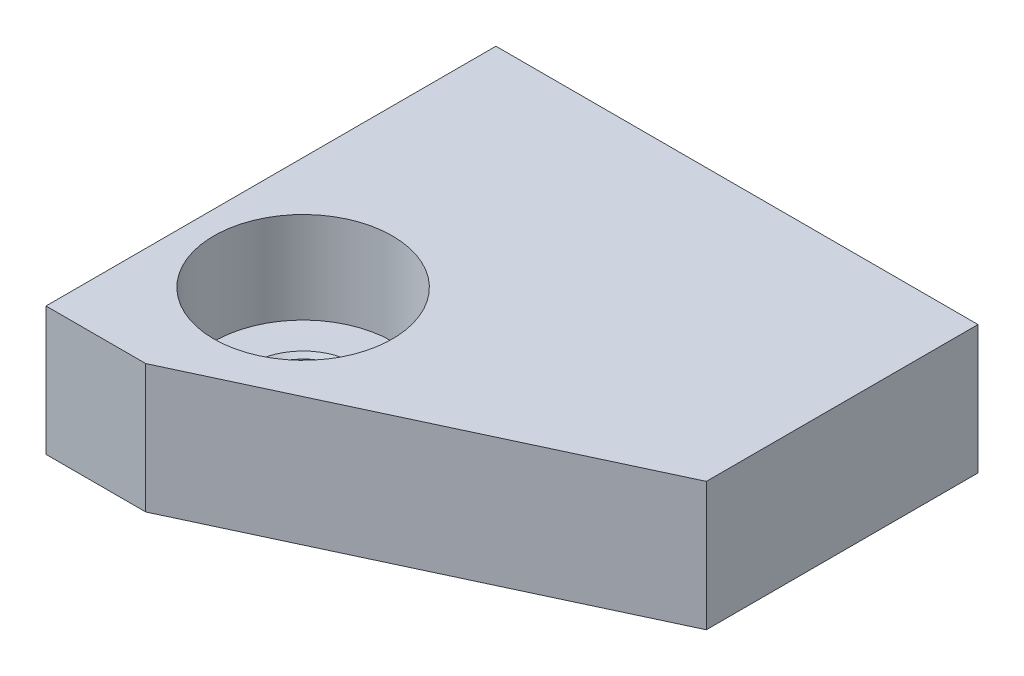
ISO-10303-21;
HEADER;
FILE_DESCRIPTION(('STEP AP214'),'2;1');
FILE_NAME('part.step','',(''),(''),'','','');
FILE_SCHEMA(('AUTOMOTIVE_DESIGN { 1 0 10303 214 1 1 1 1 }'));
ENDSEC;
DATA;
#1=APPLICATION_CONTEXT('core data for automotive mechanical design processes');
#2=APPLICATION_PROTOCOL_DEFINITION('international standard','automotive_design',2000,#1);
#3=PRODUCT_CONTEXT('',#1,'mechanical');
#4=PRODUCT('Part','Part','',(#3));
#5=PRODUCT_RELATED_PRODUCT_CATEGORY('part','',(#4));
#6=PRODUCT_DEFINITION_FORMATION('','',#4);
#7=PRODUCT_DEFINITION_CONTEXT('part definition',#1,'design');
#8=PRODUCT_DEFINITION('design','',#6,#7);
#9=PRODUCT_DEFINITION_SHAPE('','',#8);
#10=(LENGTH_UNIT() NAMED_UNIT(*) SI_UNIT(.MILLI.,.METRE.));
#11=(NAMED_UNIT(*) PLANE_ANGLE_UNIT() SI_UNIT($,.RADIAN.));
#12=(NAMED_UNIT(*) SI_UNIT($,.STERADIAN.) SOLID_ANGLE_UNIT());
#13=UNCERTAINTY_MEASURE_WITH_UNIT(LENGTH_MEASURE(1.E-05),#10,'distance_accuracy_value','');
#14=(GEOMETRIC_REPRESENTATION_CONTEXT(3) GLOBAL_UNCERTAINTY_ASSIGNED_CONTEXT((#13)) GLOBAL_UNIT_ASSIGNED_CONTEXT((#10,
#11,#12)) REPRESENTATION_CONTEXT('',''));
#15=CARTESIAN_POINT('',(0.,0.,0.));
#16=DIRECTION('',(0.,0.,1.));
#17=DIRECTION('',(1.,0.,0.));
#18=AXIS2_PLACEMENT_3D('',#15,#16,#17);
#19=CARTESIAN_POINT('',(15.,4.,0.));
#20=DIRECTION('',(0.,0.,1.));
#21=DIRECTION('',(1.,0.,0.));
#22=AXIS2_PLACEMENT_3D('',#19,#20,#21);
#23=PLANE('',#22);
#24=DIRECTION('',(-1.,0.,0.));
#25=VECTOR('',#24,1.);
#26=CARTESIAN_POINT('',(15.,0.,0.));
#27=LINE('',#26,#25);
#28=CARTESIAN_POINT('',(15.,0.,0.));
#29=VERTEX_POINT('',#28);
#30=CARTESIAN_POINT('',(0.,0.,0.));
#31=VERTEX_POINT('',#30);
#32=EDGE_CURVE('E104',#29,#31,#27,.T.);
#33=ORIENTED_EDGE('',*,*,#32,.T.);
#34=DIRECTION('',(0.,-1.,0.));
#35=VECTOR('',#34,1.);
#36=CARTESIAN_POINT('',(0.,4.,0.));
#37=LINE('',#36,#35);
#38=CARTESIAN_POINT('',(0.,4.,0.));
#39=VERTEX_POINT('',#38);
#40=EDGE_CURVE('E11',#39,#31,#37,.T.);
#41=ORIENTED_EDGE('',*,*,#40,.F.);
#42=DIRECTION('',(-1.,0.,0.));
#43=VECTOR('',#42,1.);
#44=CARTESIAN_POINT('',(15.,4.,0.));
#45=LINE('',#44,#43);
#46=CARTESIAN_POINT('',(15.,4.,0.));
#47=VERTEX_POINT('',#46);
#48=EDGE_CURVE('E113',#47,#39,#45,.T.);
#49=ORIENTED_EDGE('',*,*,#48,.F.);
#50=DIRECTION('',(0.,-1.,0.));
#51=VECTOR('',#50,1.);
#52=CARTESIAN_POINT('',(15.,4.,0.));
#53=LINE('',#52,#51);
#54=EDGE_CURVE('E100',#47,#29,#53,.T.);
#55=ORIENTED_EDGE('',*,*,#54,.T.);
#56=EDGE_LOOP('',(#33,#41,#49,#55));
#57=FACE_BOUND('',#56,.T.);
#58=ADVANCED_FACE('F30',(#57),#23,.F.);
#59=CARTESIAN_POINT('',(0.,4.,0.));
#60=DIRECTION('',(1.,0.,0.));
#61=DIRECTION('',(0.,0.,-1.));
#62=AXIS2_PLACEMENT_3D('',#59,#60,#61);
#63=PLANE('',#62);
#64=DIRECTION('',(0.,0.,1.));
#65=VECTOR('',#64,1.);
#66=CARTESIAN_POINT('',(0.,0.,0.));
#67=LINE('',#66,#65);
#68=CARTESIAN_POINT('',(0.,0.,14.));
#69=VERTEX_POINT('',#68);
#70=EDGE_CURVE('E107',#31,#69,#67,.T.);
#71=ORIENTED_EDGE('',*,*,#70,.T.);
#72=DIRECTION('',(0.,-1.,0.));
#73=VECTOR('',#72,1.);
#74=CARTESIAN_POINT('',(0.,4.,14.));
#75=LINE('',#74,#73);
#76=CARTESIAN_POINT('',(0.,4.,14.));
#77=VERTEX_POINT('',#76);
#78=EDGE_CURVE('E38',#77,#69,#75,.T.);
#79=ORIENTED_EDGE('',*,*,#78,.F.);
#80=DIRECTION('',(0.,0.,1.));
#81=VECTOR('',#80,1.);
#82=CARTESIAN_POINT('',(0.,4.,0.));
#83=LINE('',#82,#81);
#84=EDGE_CURVE('E80',#39,#77,#83,.T.);
#85=ORIENTED_EDGE('',*,*,#84,.F.);
#86=ORIENTED_EDGE('',*,*,#40,.T.);
#87=EDGE_LOOP('',(#71,#79,#85,#86));
#88=FACE_BOUND('',#87,.T.);
#89=ADVANCED_FACE('F134',(#88),#63,.F.);
#90=CARTESIAN_POINT('',(3.10372527700111,4.,14.));
#91=DIRECTION('',(0.,0.,-1.));
#92=DIRECTION('',(-1.,0.,0.));
#93=AXIS2_PLACEMENT_3D('',#90,#91,#92);
#94=PLANE('',#93);
#95=DIRECTION('',(1.,0.,0.));
#96=VECTOR('',#95,1.);
#97=CARTESIAN_POINT('',(3.10372527700111,0.,14.));
#98=LINE('',#97,#96);
#99=CARTESIAN_POINT('',(3.10372527700111,0.,14.));
#100=VERTEX_POINT('',#99);
#101=EDGE_CURVE('E95',#69,#100,#98,.T.);
#102=ORIENTED_EDGE('',*,*,#101,.T.);
#103=DIRECTION('',(0.,-1.,0.));
#104=VECTOR('',#103,1.);
#105=CARTESIAN_POINT('',(3.10372527700111,4.,14.));
#106=LINE('',#105,#104);
#107=CARTESIAN_POINT('',(3.10372527700111,4.,14.));
#108=VERTEX_POINT('',#107);
#109=EDGE_CURVE('E92',#108,#100,#106,.T.);
#110=ORIENTED_EDGE('',*,*,#109,.F.);
#111=DIRECTION('',(1.,0.,0.));
#112=VECTOR('',#111,1.);
#113=CARTESIAN_POINT('',(3.10372527700111,4.,14.));
#114=LINE('',#113,#112);
#115=EDGE_CURVE('E84',#77,#108,#114,.T.);
#116=ORIENTED_EDGE('',*,*,#115,.F.);
#117=ORIENTED_EDGE('',*,*,#78,.T.);
#118=EDGE_LOOP('',(#102,#110,#116,#117));
#119=FACE_BOUND('',#118,.T.);
#120=ADVANCED_FACE('F93',(#119),#94,.F.);
#121=CARTESIAN_POINT('',(3.10372527700111,4.,14.));
#122=DIRECTION('',(-0.422618261740694,0.,-0.906307787036653));
#123=DIRECTION('',(-0.906307787036653,0.,0.422618261740694));
#124=AXIS2_PLACEMENT_3D('',#121,#122,#123);
#125=PLANE('',#124);
#126=DIRECTION('',(0.906307787036652,0.,-0.422618261740694));
#127=VECTOR('',#126,1.);
#128=CARTESIAN_POINT('',(3.10372527700111,0.,14.));
#129=LINE('',#128,#127);
#130=CARTESIAN_POINT('',(15.,0.,8.45267599314998));
#131=VERTEX_POINT('',#130);
#132=EDGE_CURVE('E66',#100,#131,#129,.T.);
#133=ORIENTED_EDGE('',*,*,#132,.T.);
#134=DIRECTION('',(0.,-1.,0.));
#135=VECTOR('',#134,1.);
#136=CARTESIAN_POINT('',(15.,4.,8.45267599314998));
#137=LINE('',#136,#135);
#138=CARTESIAN_POINT('',(15.,4.,8.45267599314998));
#139=VERTEX_POINT('',#138);
#140=EDGE_CURVE('E96',#139,#131,#137,.T.);
#141=ORIENTED_EDGE('',*,*,#140,.F.);
#142=DIRECTION('',(0.906307787036652,0.,-0.422618261740694));
#143=VECTOR('',#142,1.);
#144=CARTESIAN_POINT('',(3.10372527700111,4.,14.));
#145=LINE('',#144,#143);
#146=EDGE_CURVE('E88',#108,#139,#145,.T.);
#147=ORIENTED_EDGE('',*,*,#146,.F.);
#148=ORIENTED_EDGE('',*,*,#109,.T.);
#149=EDGE_LOOP('',(#133,#141,#147,#148));
#150=FACE_BOUND('',#149,.T.);
#151=ADVANCED_FACE('F98',(#150),#125,.F.);
#152=CARTESIAN_POINT('',(15.,4.,8.45267599314998));
#153=DIRECTION('',(-1.,0.,0.));
#154=DIRECTION('',(0.,0.,1.));
#155=AXIS2_PLACEMENT_3D('',#152,#153,#154);
#156=PLANE('',#155);
#157=DIRECTION('',(0.,0.,-1.));
#158=VECTOR('',#157,1.);
#159=CARTESIAN_POINT('',(15.,0.,8.45267599314998));
#160=LINE('',#159,#158);
#161=EDGE_CURVE('E72',#131,#29,#160,.T.);
#162=ORIENTED_EDGE('',*,*,#161,.T.);
#163=ORIENTED_EDGE('',*,*,#54,.F.);
#164=DIRECTION('',(0.,0.,-1.));
#165=VECTOR('',#164,1.);
#166=CARTESIAN_POINT('',(15.,4.,8.45267599314998));
#167=LINE('',#166,#165);
#168=EDGE_CURVE('E46',#139,#47,#167,.T.);
#169=ORIENTED_EDGE('',*,*,#168,.F.);
#170=ORIENTED_EDGE('',*,*,#140,.T.);
#171=EDGE_LOOP('',(#162,#163,#169,#170));
#172=FACE_BOUND('',#171,.T.);
#173=ADVANCED_FACE('F121',(#172),#156,.F.);
#174=CARTESIAN_POINT('',(0.,4.,0.));
#175=DIRECTION('',(0.,1.,0.));
#176=DIRECTION('',(0.,0.,1.));
#177=AXIS2_PLACEMENT_3D('',#174,#175,#176);
#178=PLANE('',#177);
#179=CARTESIAN_POINT('',(3.5,4.,9.5));
#180=DIRECTION('',(0.,1.,0.));
#181=DIRECTION('',(0.,0.,1.));
#182=AXIS2_PLACEMENT_3D('',#179,#180,#181);
#183=CIRCLE('',#182,2.77875999999999);
#184=CARTESIAN_POINT('',(3.5,4.,12.27876));
#185=VERTEX_POINT('',#184);
#186=EDGE_CURVE('E221',#185,#185,#183,.T.);
#187=ORIENTED_EDGE('',*,*,#186,.F.);
#188=EDGE_LOOP('',(#187));
#189=FACE_BOUND('',#188,.T.);
#190=ORIENTED_EDGE('',*,*,#48,.T.);
#191=ORIENTED_EDGE('',*,*,#84,.T.);
#192=ORIENTED_EDGE('',*,*,#115,.T.);
#193=ORIENTED_EDGE('',*,*,#146,.T.);
#194=ORIENTED_EDGE('',*,*,#168,.T.);
#195=EDGE_LOOP('',(#190,#191,#192,#193,#194));
#196=FACE_BOUND('',#195,.T.);
#197=ADVANCED_FACE('F86',(#189,#196),#178,.T.);
#198=CARTESIAN_POINT('',(0.,0.,0.));
#199=DIRECTION('',(0.,1.,0.));
#200=DIRECTION('',(0.,0.,1.));
#201=AXIS2_PLACEMENT_3D('',#198,#199,#200);
#202=PLANE('',#201);
#203=CARTESIAN_POINT('',(3.5,0.,9.5));
#204=DIRECTION('',(0.,1.,0.));
#205=DIRECTION('',(0.,0.,1.));
#206=AXIS2_PLACEMENT_3D('',#203,#204,#205);
#207=CIRCLE('',#206,1.6002);
#208=CARTESIAN_POINT('',(3.5,0.,11.1002));
#209=VERTEX_POINT('',#208);
#210=EDGE_CURVE('E222',#209,#209,#207,.T.);
#211=ORIENTED_EDGE('',*,*,#210,.T.);
#212=EDGE_LOOP('',(#211));
#213=FACE_BOUND('',#212,.T.);
#214=ORIENTED_EDGE('',*,*,#32,.F.);
#215=ORIENTED_EDGE('',*,*,#161,.F.);
#216=ORIENTED_EDGE('',*,*,#132,.F.);
#217=ORIENTED_EDGE('',*,*,#101,.F.);
#218=ORIENTED_EDGE('',*,*,#70,.F.);
#219=EDGE_LOOP('',(#214,#215,#216,#217,#218));
#220=FACE_BOUND('',#219,.T.);
#221=ADVANCED_FACE('F117',(#213,#220),#202,.F.);
#222=CARTESIAN_POINT('',(3.5,0.126999999999999,9.5));
#223=DIRECTION('',(0.,-1.,0.));
#224=DIRECTION('',(0.,0.,-1.));
#225=AXIS2_PLACEMENT_3D('',#222,#223,#224);
#226=CONICAL_SURFACE('',#225,1.47320000000001,0.785398163397401);
#227=ORIENTED_EDGE('',*,*,#210,.F.);
#228=EDGE_LOOP('',(#227));
#229=FACE_BOUND('',#228,.T.);
#230=CARTESIAN_POINT('',(3.5,0.126999999999999,9.5));
#231=DIRECTION('',(0.,1.,0.));
#232=DIRECTION('',(0.,0.,1.));
#233=AXIS2_PLACEMENT_3D('',#230,#231,#232);
#234=CIRCLE('',#233,1.47320000000001);
#235=CARTESIAN_POINT('',(3.5,0.126999999999999,10.9732));
#236=VERTEX_POINT('',#235);
#237=EDGE_CURVE('E108',#236,#236,#234,.T.);
#238=ORIENTED_EDGE('',*,*,#237,.T.);
#239=EDGE_LOOP('',(#238));
#240=FACE_BOUND('',#239,.T.);
#241=ADVANCED_FACE('F163',(#229,#240),#226,.F.);
#242=CARTESIAN_POINT('',(3.5,4.,9.5));
#243=DIRECTION('',(0.,1.,0.));
#244=DIRECTION('',(0.,0.,1.));
#245=AXIS2_PLACEMENT_3D('',#242,#243,#244);
#246=CYLINDRICAL_SURFACE('',#245,1.47320000000001);
#247=ORIENTED_EDGE('',*,*,#237,.F.);
#248=EDGE_LOOP('',(#247));
#249=FACE_BOUND('',#248,.T.);
#250=CARTESIAN_POINT('',(3.5,1.0282,9.5));
#251=DIRECTION('',(0.,1.,0.));
#252=DIRECTION('',(0.,0.,1.));
#253=AXIS2_PLACEMENT_3D('',#250,#251,#252);
#254=CIRCLE('',#253,1.47320000000001);
#255=CARTESIAN_POINT('',(3.5,1.0282,10.9732));
#256=VERTEX_POINT('',#255);
#257=EDGE_CURVE('E231',#256,#256,#254,.T.);
#258=ORIENTED_EDGE('',*,*,#257,.T.);
#259=EDGE_LOOP('',(#258));
#260=FACE_BOUND('',#259,.T.);
#261=ADVANCED_FACE('F171',(#249,#260),#246,.F.);
#262=CARTESIAN_POINT('',(3.5,1.1552,9.5));
#263=DIRECTION('',(0.,1.,0.));
#264=DIRECTION('',(0.,0.,1.));
#265=AXIS2_PLACEMENT_3D('',#262,#263,#264);
#266=CONICAL_SURFACE('',#265,1.6002,0.785398163397421);
#267=ORIENTED_EDGE('',*,*,#257,.F.);
#268=EDGE_LOOP('',(#267));
#269=FACE_BOUND('',#268,.T.);
#270=CARTESIAN_POINT('',(3.5,1.1552,9.5));
#271=DIRECTION('',(0.,1.,0.));
#272=DIRECTION('',(0.,0.,1.));
#273=AXIS2_PLACEMENT_3D('',#270,#271,#272);
#274=CIRCLE('',#273,1.6002);
#275=CARTESIAN_POINT('',(3.5,1.1552,11.1002));
#276=VERTEX_POINT('',#275);
#277=EDGE_CURVE('E224',#276,#276,#274,.T.);
#278=ORIENTED_EDGE('',*,*,#277,.T.);
#279=EDGE_LOOP('',(#278));
#280=FACE_BOUND('',#279,.T.);
#281=ADVANCED_FACE('F181',(#269,#280),#266,.F.);
#282=CARTESIAN_POINT('',(5.1002,1.1552,9.5));
#283=DIRECTION('',(0.,-1.,0.));
#284=DIRECTION('',(0.,0.,-1.));
#285=AXIS2_PLACEMENT_3D('',#282,#283,#284);
#286=PLANE('',#285);
#287=ORIENTED_EDGE('',*,*,#277,.F.);
#288=EDGE_LOOP('',(#287));
#289=FACE_BOUND('',#288,.T.);
#290=CARTESIAN_POINT('',(3.5,1.1552,9.5));
#291=DIRECTION('',(0.,1.,0.));
#292=DIRECTION('',(0.,0.,1.));
#293=AXIS2_PLACEMENT_3D('',#290,#291,#292);
#294=CIRCLE('',#293,2.77875999999999);
#295=CARTESIAN_POINT('',(3.5,1.1552,12.27876));
#296=VERTEX_POINT('',#295);
#297=EDGE_CURVE('E218',#296,#296,#294,.T.);
#298=ORIENTED_EDGE('',*,*,#297,.T.);
#299=EDGE_LOOP('',(#298));
#300=FACE_BOUND('',#299,.T.);
#301=ADVANCED_FACE('F191',(#289,#300),#286,.F.);
#302=CARTESIAN_POINT('',(3.5,4.,9.5));
#303=DIRECTION('',(0.,1.,0.));
#304=DIRECTION('',(0.,0.,1.));
#305=AXIS2_PLACEMENT_3D('',#302,#303,#304);
#306=CYLINDRICAL_SURFACE('',#305,2.77875999999999);
#307=ORIENTED_EDGE('',*,*,#297,.F.);
#308=EDGE_LOOP('',(#307));
#309=FACE_BOUND('',#308,.T.);
#310=ORIENTED_EDGE('',*,*,#186,.T.);
#311=EDGE_LOOP('',(#310));
#312=FACE_BOUND('',#311,.T.);
#313=ADVANCED_FACE('F201',(#309,#312),#306,.F.);
#314=CLOSED_SHELL('',(#58,#89,#120,#151,#173,#197,#221,#241,#261,#281,#301,#313));
#315=MANIFOLD_SOLID_BREP('B2',#314);
#316=ADVANCED_BREP_SHAPE_REPRESENTATION('',(#18,#315),#14);
#317=SHAPE_DEFINITION_REPRESENTATION(#9,#316);
ENDSEC;
END-ISO-10303-21;
